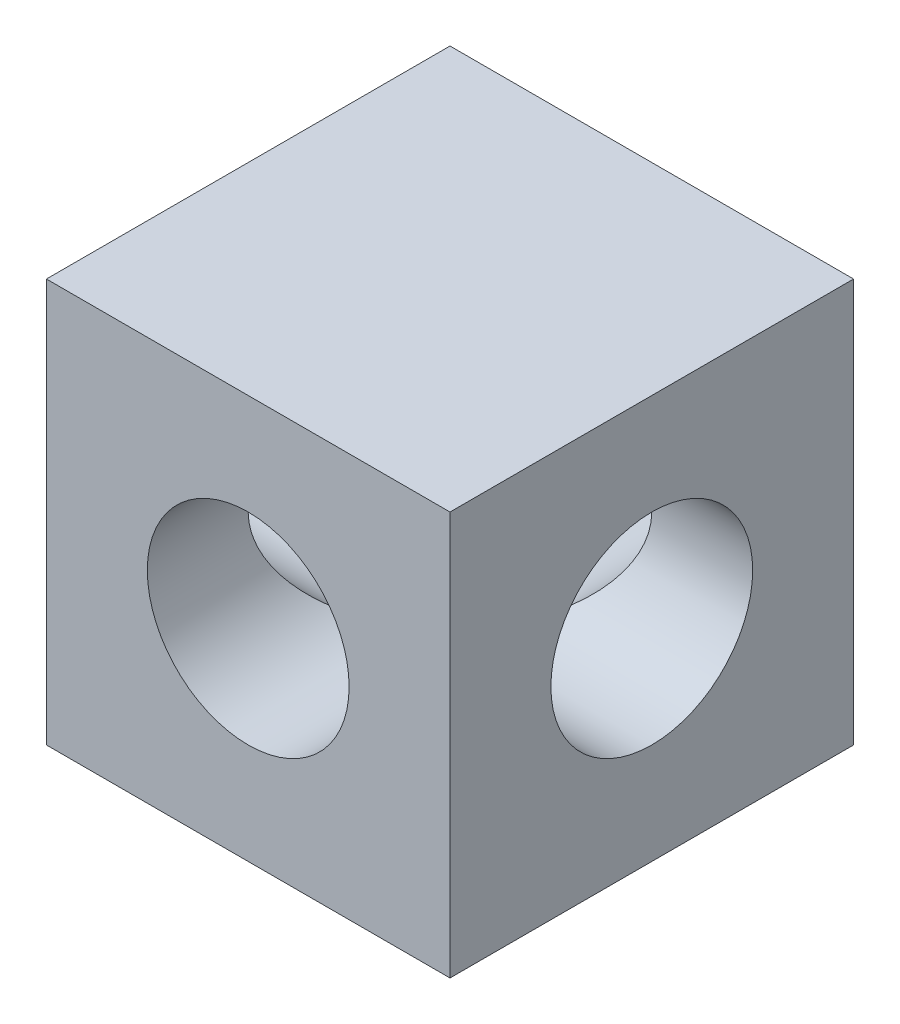
ISO-10303-21;
HEADER;
FILE_DESCRIPTION(('STEP AP214'),'2;1');
FILE_NAME('part.step','',(''),(''),'','','');
FILE_SCHEMA(('AUTOMOTIVE_DESIGN { 1 0 10303 214 1 1 1 1 }'));
ENDSEC;
DATA;
#1=APPLICATION_CONTEXT('core data for automotive mechanical design processes');
#2=APPLICATION_PROTOCOL_DEFINITION('international standard','automotive_design',2000,#1);
#3=PRODUCT_CONTEXT('',#1,'mechanical');
#4=PRODUCT('Part','Part','',(#3));
#5=PRODUCT_RELATED_PRODUCT_CATEGORY('part','',(#4));
#6=PRODUCT_DEFINITION_FORMATION('','',#4);
#7=PRODUCT_DEFINITION_CONTEXT('part definition',#1,'design');
#8=PRODUCT_DEFINITION('design','',#6,#7);
#9=PRODUCT_DEFINITION_SHAPE('','',#8);
#10=(LENGTH_UNIT() NAMED_UNIT(*) SI_UNIT(.MILLI.,.METRE.));
#11=(NAMED_UNIT(*) PLANE_ANGLE_UNIT() SI_UNIT($,.RADIAN.));
#12=(NAMED_UNIT(*) SI_UNIT($,.STERADIAN.) SOLID_ANGLE_UNIT());
#13=UNCERTAINTY_MEASURE_WITH_UNIT(LENGTH_MEASURE(1.E-05),#10,'distance_accuracy_value','');
#14=(GEOMETRIC_REPRESENTATION_CONTEXT(3) GLOBAL_UNCERTAINTY_ASSIGNED_CONTEXT((#13)) GLOBAL_UNIT_ASSIGNED_CONTEXT((#10,
#11,#12)) REPRESENTATION_CONTEXT('',''));
#15=CARTESIAN_POINT('',(0.,0.,0.));
#16=DIRECTION('',(0.,0.,1.));
#17=DIRECTION('',(1.,0.,0.));
#18=AXIS2_PLACEMENT_3D('',#15,#16,#17);
#19=CARTESIAN_POINT('',(4.67803408341162E-05,0.,6.19120321965917));
#20=DIRECTION('',(0.,0.,-1.));
#21=DIRECTION('',(-1.,0.,0.));
#22=AXIS2_PLACEMENT_3D('',#19,#20,#21);
#23=CYLINDRICAL_SURFACE('',#22,3.095625);
#24=CARTESIAN_POINT('',(4.67803408341162E-05,0.,-4.67803408351647E-05));
#25=DIRECTION('',(0.707106781186548,0.,-0.707106781186547));
#26=DIRECTION('',(-0.707106781186548,0.,-0.707106781186547));
#27=AXIS2_PLACEMENT_3D('',#24,#25,#26);
#28=ELLIPSE('',#27,4.37787485902121,3.095625);
#29=CARTESIAN_POINT('',(4.67803408341162E-05,-3.095625,-4.67803408351647E-05));
#30=VERTEX_POINT('',#29);
#31=CARTESIAN_POINT('',(4.67803408341162E-05,3.095625,-4.67803408351647E-05));
#32=VERTEX_POINT('',#31);
#33=EDGE_CURVE('E11',#30,#32,#28,.F.);
#34=ORIENTED_EDGE('',*,*,#33,.F.);
#35=CARTESIAN_POINT('',(4.67803408341162E-05,0.,-4.67803408351647E-05));
#36=DIRECTION('',(-0.707106781186548,0.,-0.707106781186547));
#37=DIRECTION('',(0.707106781186548,0.,-0.707106781186547));
#38=AXIS2_PLACEMENT_3D('',#35,#36,#37);
#39=ELLIPSE('',#38,4.37787485902121,3.095625);
#40=EDGE_CURVE('E57',#32,#30,#39,.F.);
#41=ORIENTED_EDGE('',*,*,#40,.F.);
#42=EDGE_LOOP('',(#34,#41));
#43=FACE_BOUND('',#42,.T.);
#44=CARTESIAN_POINT('',(4.67803408341162E-05,0.,6.19120321965917));
#45=DIRECTION('',(0.,0.,1.));
#46=DIRECTION('',(1.,0.,0.));
#47=AXIS2_PLACEMENT_3D('',#44,#45,#46);
#48=CIRCLE('',#47,3.095625);
#49=CARTESIAN_POINT('',(3.09567178034083,0.,6.19120321965917));
#50=VERTEX_POINT('',#49);
#51=EDGE_CURVE('E145',#50,#50,#48,.T.);
#52=ORIENTED_EDGE('',*,*,#51,.T.);
#53=EDGE_LOOP('',(#52));
#54=FACE_BOUND('',#53,.T.);
#55=ADVANCED_FACE('F42',(#43,#54),#23,.F.);
#56=CARTESIAN_POINT('',(-6.19120321965917,-6.19125,6.19120321965917));
#57=DIRECTION('',(0.,0.,-1.));
#58=DIRECTION('',(-1.,0.,0.));
#59=AXIS2_PLACEMENT_3D('',#56,#57,#58);
#60=PLANE('',#59);
#61=DIRECTION('',(0.,1.,0.));
#62=VECTOR('',#61,1.);
#63=CARTESIAN_POINT('',(-6.19120321965917,-6.19125,6.19120321965917));
#64=LINE('',#63,#62);
#65=CARTESIAN_POINT('',(-6.19120321965917,-6.19125,6.19120321965917));
#66=VERTEX_POINT('',#65);
#67=CARTESIAN_POINT('',(-6.19120321965917,6.19125,6.19120321965917));
#68=VERTEX_POINT('',#67);
#69=EDGE_CURVE('E132',#66,#68,#64,.T.);
#70=ORIENTED_EDGE('',*,*,#69,.F.);
#71=DIRECTION('',(1.,0.,0.));
#72=VECTOR('',#71,1.);
#73=CARTESIAN_POINT('',(-6.19120321965917,-6.19125,6.19120321965917));
#74=LINE('',#73,#72);
#75=CARTESIAN_POINT('',(6.19129678034084,-6.19125,6.19120321965917));
#76=VERTEX_POINT('',#75);
#77=EDGE_CURVE('E121',#66,#76,#74,.T.);
#78=ORIENTED_EDGE('',*,*,#77,.T.);
#79=DIRECTION('',(0.,-1.,0.));
#80=VECTOR('',#79,1.);
#81=CARTESIAN_POINT('',(6.19129678034083,6.19125,6.19120321965917));
#82=LINE('',#81,#80);
#83=CARTESIAN_POINT('',(6.19129678034083,6.19125,6.19120321965917));
#84=VERTEX_POINT('',#83);
#85=EDGE_CURVE('E148',#84,#76,#82,.T.);
#86=ORIENTED_EDGE('',*,*,#85,.F.);
#87=DIRECTION('',(-1.,0.,0.));
#88=VECTOR('',#87,1.);
#89=CARTESIAN_POINT('',(6.19129678034083,6.19125,6.19120321965917));
#90=LINE('',#89,#88);
#91=EDGE_CURVE('E93',#84,#68,#90,.T.);
#92=ORIENTED_EDGE('',*,*,#91,.T.);
#93=EDGE_LOOP('',(#70,#78,#86,#92));
#94=FACE_BOUND('',#93,.T.);
#95=ORIENTED_EDGE('',*,*,#51,.F.);
#96=EDGE_LOOP('',(#95));
#97=FACE_BOUND('',#96,.T.);
#98=ADVANCED_FACE('F181',(#94,#97),#60,.F.);
#99=CARTESIAN_POINT('',(-6.19120321965917,-6.19125,-6.19129678034083));
#100=DIRECTION('',(0.,0.,-1.));
#101=DIRECTION('',(-1.,0.,0.));
#102=AXIS2_PLACEMENT_3D('',#99,#100,#101);
#103=PLANE('',#102);
#104=DIRECTION('',(0.,1.,0.));
#105=VECTOR('',#104,1.);
#106=CARTESIAN_POINT('',(-6.19120321965917,-6.19125,-6.19129678034083));
#107=LINE('',#106,#105);
#108=CARTESIAN_POINT('',(-6.19120321965917,-6.19125,-6.19129678034083));
#109=VERTEX_POINT('',#108);
#110=CARTESIAN_POINT('',(-6.19120321965917,6.19125,-6.19129678034083));
#111=VERTEX_POINT('',#110);
#112=EDGE_CURVE('E141',#109,#111,#107,.T.);
#113=ORIENTED_EDGE('',*,*,#112,.T.);
#114=DIRECTION('',(-1.,0.,0.));
#115=VECTOR('',#114,1.);
#116=CARTESIAN_POINT('',(6.19129678034083,6.19125,-6.19129678034083));
#117=LINE('',#116,#115);
#118=CARTESIAN_POINT('',(6.19129678034083,6.19125,-6.19129678034083));
#119=VERTEX_POINT('',#118);
#120=EDGE_CURVE('E137',#119,#111,#117,.T.);
#121=ORIENTED_EDGE('',*,*,#120,.F.);
#122=DIRECTION('',(0.,-1.,0.));
#123=VECTOR('',#122,1.);
#124=CARTESIAN_POINT('',(6.19129678034083,6.19125,-6.19129678034083));
#125=LINE('',#124,#123);
#126=CARTESIAN_POINT('',(6.19129678034084,-6.19125,-6.19129678034083));
#127=VERTEX_POINT('',#126);
#128=EDGE_CURVE('E133',#119,#127,#125,.T.);
#129=ORIENTED_EDGE('',*,*,#128,.T.);
#130=DIRECTION('',(1.,0.,0.));
#131=VECTOR('',#130,1.);
#132=CARTESIAN_POINT('',(-6.19120321965917,-6.19125,-6.19129678034083));
#133=LINE('',#132,#131);
#134=EDGE_CURVE('E129',#109,#127,#133,.T.);
#135=ORIENTED_EDGE('',*,*,#134,.F.);
#136=EDGE_LOOP('',(#113,#121,#129,#135));
#137=FACE_BOUND('',#136,.T.);
#138=CARTESIAN_POINT('',(4.67803408341162E-05,0.,-6.19129678034083));
#139=DIRECTION('',(0.,0.,1.));
#140=DIRECTION('',(1.,0.,0.));
#141=AXIS2_PLACEMENT_3D('',#138,#139,#140);
#142=CIRCLE('',#141,3.095625);
#143=CARTESIAN_POINT('',(3.09567178034083,0.,-6.19129678034083));
#144=VERTEX_POINT('',#143);
#145=EDGE_CURVE('E156',#144,#144,#142,.T.);
#146=ORIENTED_EDGE('',*,*,#145,.T.);
#147=EDGE_LOOP('',(#146));
#148=FACE_BOUND('',#147,.T.);
#149=ADVANCED_FACE('F185',(#137,#148),#103,.T.);
#150=CARTESIAN_POINT('',(-6.19120321965917,-6.19125,6.19120321965917));
#151=DIRECTION('',(-1.,0.,0.));
#152=DIRECTION('',(0.,-1.,0.));
#153=AXIS2_PLACEMENT_3D('',#150,#151,#152);
#154=PLANE('',#153);
#155=CARTESIAN_POINT('',(-6.19120321965917,0.,-4.67803408357285E-05));
#156=DIRECTION('',(1.,0.,0.));
#157=DIRECTION('',(0.,0.,-1.));
#158=AXIS2_PLACEMENT_3D('',#155,#156,#157);
#159=CIRCLE('',#158,3.095625);
#160=CARTESIAN_POINT('',(-6.19120321965917,0.,-3.09567178034084));
#161=VERTEX_POINT('',#160);
#162=EDGE_CURVE('E160',#161,#161,#159,.T.);
#163=ORIENTED_EDGE('',*,*,#162,.T.);
#164=EDGE_LOOP('',(#163));
#165=FACE_BOUND('',#164,.T.);
#166=ORIENTED_EDGE('',*,*,#112,.F.);
#167=DIRECTION('',(0.,0.,-1.));
#168=VECTOR('',#167,1.);
#169=CARTESIAN_POINT('',(-6.19120321965917,-6.19125,6.19120321965917));
#170=LINE('',#169,#168);
#171=EDGE_CURVE('E66',#66,#109,#170,.T.);
#172=ORIENTED_EDGE('',*,*,#171,.F.);
#173=ORIENTED_EDGE('',*,*,#69,.T.);
#174=DIRECTION('',(0.,0.,-1.));
#175=VECTOR('',#174,1.);
#176=CARTESIAN_POINT('',(-6.19120321965917,6.19125,6.19120321965917));
#177=LINE('',#176,#175);
#178=EDGE_CURVE('E117',#68,#111,#177,.T.);
#179=ORIENTED_EDGE('',*,*,#178,.T.);
#180=EDGE_LOOP('',(#166,#172,#173,#179));
#181=FACE_BOUND('',#180,.T.);
#182=ADVANCED_FACE('F44',(#165,#181),#154,.T.);
#183=CARTESIAN_POINT('',(-6.19120321965917,-6.19125,6.19120321965917));
#184=DIRECTION('',(0.,1.,0.));
#185=DIRECTION('',(-1.,0.,0.));
#186=AXIS2_PLACEMENT_3D('',#183,#184,#185);
#187=PLANE('',#186);
#188=ORIENTED_EDGE('',*,*,#134,.T.);
#189=DIRECTION('',(0.,0.,-1.));
#190=VECTOR('',#189,1.);
#191=CARTESIAN_POINT('',(6.19129678034084,-6.19125,6.19120321965917));
#192=LINE('',#191,#190);
#193=EDGE_CURVE('E124',#76,#127,#192,.T.);
#194=ORIENTED_EDGE('',*,*,#193,.F.);
#195=ORIENTED_EDGE('',*,*,#77,.F.);
#196=ORIENTED_EDGE('',*,*,#171,.T.);
#197=EDGE_LOOP('',(#188,#194,#195,#196));
#198=FACE_BOUND('',#197,.T.);
#199=ADVANCED_FACE('F191',(#198),#187,.F.);
#200=CARTESIAN_POINT('',(6.19129678034083,6.19125,6.19120321965917));
#201=DIRECTION('',(1.,0.,0.));
#202=DIRECTION('',(0.,1.,0.));
#203=AXIS2_PLACEMENT_3D('',#200,#201,#202);
#204=PLANE('',#203);
#205=CARTESIAN_POINT('',(6.19129678034084,0.,-4.67803408357285E-05));
#206=DIRECTION('',(1.,0.,0.));
#207=DIRECTION('',(0.,0.,-1.));
#208=AXIS2_PLACEMENT_3D('',#205,#206,#207);
#209=CIRCLE('',#208,3.095625);
#210=CARTESIAN_POINT('',(6.19129678034084,0.,-3.09567178034084));
#211=VERTEX_POINT('',#210);
#212=EDGE_CURVE('E164',#211,#211,#209,.T.);
#213=ORIENTED_EDGE('',*,*,#212,.F.);
#214=EDGE_LOOP('',(#213));
#215=FACE_BOUND('',#214,.T.);
#216=ORIENTED_EDGE('',*,*,#128,.F.);
#217=DIRECTION('',(0.,0.,-1.));
#218=VECTOR('',#217,1.);
#219=CARTESIAN_POINT('',(6.19129678034083,6.19125,6.19120321965917));
#220=LINE('',#219,#218);
#221=EDGE_CURVE('E120',#84,#119,#220,.T.);
#222=ORIENTED_EDGE('',*,*,#221,.F.);
#223=ORIENTED_EDGE('',*,*,#85,.T.);
#224=ORIENTED_EDGE('',*,*,#193,.T.);
#225=EDGE_LOOP('',(#216,#222,#223,#224));
#226=FACE_BOUND('',#225,.T.);
#227=ADVANCED_FACE('F194',(#215,#226),#204,.T.);
#228=CARTESIAN_POINT('',(6.19129678034083,6.19125,6.19120321965917));
#229=DIRECTION('',(0.,-1.,0.));
#230=DIRECTION('',(1.,0.,0.));
#231=AXIS2_PLACEMENT_3D('',#228,#229,#230);
#232=PLANE('',#231);
#233=ORIENTED_EDGE('',*,*,#120,.T.);
#234=ORIENTED_EDGE('',*,*,#178,.F.);
#235=ORIENTED_EDGE('',*,*,#91,.F.);
#236=ORIENTED_EDGE('',*,*,#221,.T.);
#237=EDGE_LOOP('',(#233,#234,#235,#236));
#238=FACE_BOUND('',#237,.T.);
#239=ADVANCED_FACE('F178',(#238),#232,.F.);
#240=CARTESIAN_POINT('',(4.67803408341162E-05,0.,-4.67803408351647E-05));
#241=DIRECTION('',(0.707106781186548,0.,-0.707106781186547));
#242=DIRECTION('',(-0.707106781186548,0.,-0.707106781186547));
#243=AXIS2_PLACEMENT_3D('',#240,#241,#242);
#244=ELLIPSE('',#243,4.37787485902121,3.095625);
#245=EDGE_CURVE('E51',#30,#32,#244,.T.);
#246=ORIENTED_EDGE('',*,*,#245,.F.);
#247=CARTESIAN_POINT('',(4.67803408341162E-05,0.,-4.67803408351647E-05));
#248=DIRECTION('',(-0.707106781186548,0.,-0.707106781186547));
#249=DIRECTION('',(0.707106781186548,0.,-0.707106781186547));
#250=AXIS2_PLACEMENT_3D('',#247,#248,#249);
#251=ELLIPSE('',#250,4.37787485902121,3.095625);
#252=EDGE_CURVE('E100',#32,#30,#251,.T.);
#253=ORIENTED_EDGE('',*,*,#252,.F.);
#254=EDGE_LOOP('',(#246,#253));
#255=FACE_BOUND('',#254,.T.);
#256=ORIENTED_EDGE('',*,*,#145,.F.);
#257=EDGE_LOOP('',(#256));
#258=FACE_BOUND('',#257,.T.);
#259=ADVANCED_FACE('F113',(#255,#258),#23,.F.);
#260=CARTESIAN_POINT('',(-6.19120321965917,0.,-4.67803408357285E-05));
#261=DIRECTION('',(1.,0.,0.));
#262=DIRECTION('',(0.,0.,-1.));
#263=AXIS2_PLACEMENT_3D('',#260,#261,#262);
#264=CYLINDRICAL_SURFACE('',#263,3.095625);
#265=ORIENTED_EDGE('',*,*,#245,.T.);
#266=ORIENTED_EDGE('',*,*,#40,.T.);
#267=EDGE_LOOP('',(#265,#266));
#268=FACE_BOUND('',#267,.T.);
#269=ORIENTED_EDGE('',*,*,#162,.F.);
#270=EDGE_LOOP('',(#269));
#271=FACE_BOUND('',#270,.T.);
#272=ADVANCED_FACE('F108',(#268,#271),#264,.F.);
#273=ORIENTED_EDGE('',*,*,#33,.T.);
#274=ORIENTED_EDGE('',*,*,#252,.T.);
#275=EDGE_LOOP('',(#273,#274));
#276=FACE_BOUND('',#275,.T.);
#277=ORIENTED_EDGE('',*,*,#212,.T.);
#278=EDGE_LOOP('',(#277));
#279=FACE_BOUND('',#278,.T.);
#280=ADVANCED_FACE('F101',(#276,#279),#264,.F.);
#281=CLOSED_SHELL('',(#55,#98,#149,#182,#199,#227,#239,#259,#272,#280));
#282=MANIFOLD_SOLID_BREP('B2',#281);
#283=ADVANCED_BREP_SHAPE_REPRESENTATION('',(#18,#282),#14);
#284=SHAPE_DEFINITION_REPRESENTATION(#9,#283);
ENDSEC;
END-ISO-10303-21;
